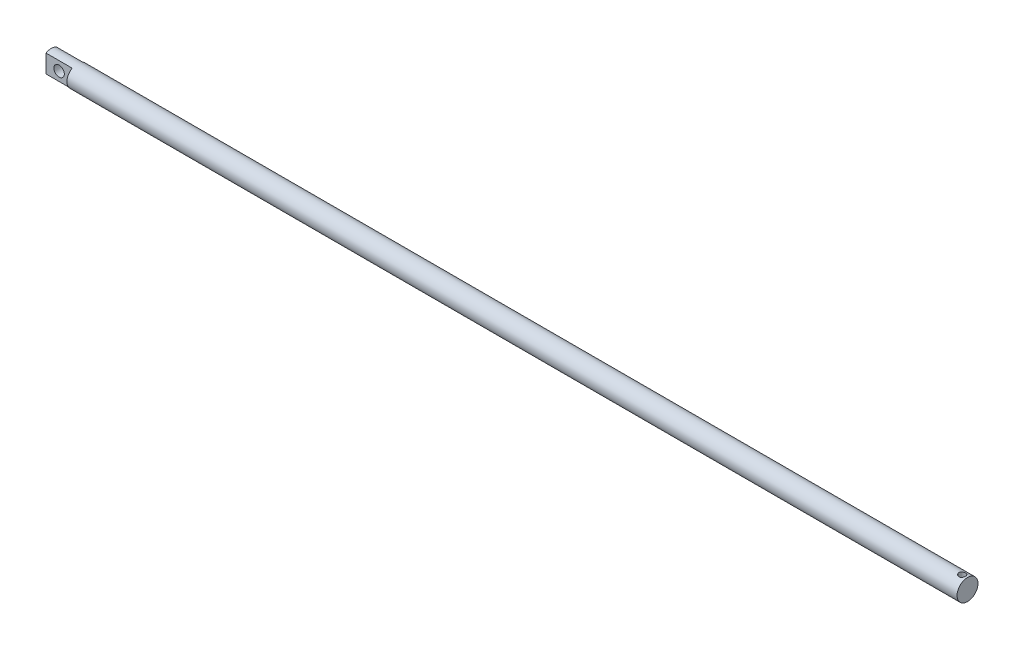
ISO-10303-21;
HEADER;
FILE_DESCRIPTION(('STEP AP214'),'2;1');
FILE_NAME('part.step','',(''),(''),'','','');
FILE_SCHEMA(('AUTOMOTIVE_DESIGN { 1 0 10303 214 1 1 1 1 }'));
ENDSEC;
DATA;
#1=APPLICATION_CONTEXT('core data for automotive mechanical design processes');
#2=APPLICATION_PROTOCOL_DEFINITION('international standard','automotive_design',2000,#1);
#3=PRODUCT_CONTEXT('',#1,'mechanical');
#4=PRODUCT('Part','Part','',(#3));
#5=PRODUCT_RELATED_PRODUCT_CATEGORY('part','',(#4));
#6=PRODUCT_DEFINITION_FORMATION('','',#4);
#7=PRODUCT_DEFINITION_CONTEXT('part definition',#1,'design');
#8=PRODUCT_DEFINITION('design','',#6,#7);
#9=PRODUCT_DEFINITION_SHAPE('','',#8);
#10=(LENGTH_UNIT() NAMED_UNIT(*) SI_UNIT(.MILLI.,.METRE.));
#11=(NAMED_UNIT(*) PLANE_ANGLE_UNIT() SI_UNIT($,.RADIAN.));
#12=(NAMED_UNIT(*) SI_UNIT($,.STERADIAN.) SOLID_ANGLE_UNIT());
#13=UNCERTAINTY_MEASURE_WITH_UNIT(LENGTH_MEASURE(1.E-05),#10,'distance_accuracy_value','');
#14=(GEOMETRIC_REPRESENTATION_CONTEXT(3) GLOBAL_UNCERTAINTY_ASSIGNED_CONTEXT((#13)) GLOBAL_UNIT_ASSIGNED_CONTEXT((#10,
#11,#12)) REPRESENTATION_CONTEXT('',''));
#15=CARTESIAN_POINT('',(0.,0.,0.));
#16=DIRECTION('',(0.,0.,1.));
#17=DIRECTION('',(1.,0.,0.));
#18=AXIS2_PLACEMENT_3D('',#15,#16,#17);
#19=CARTESIAN_POINT('',(700.,0.,0.));
#20=DIRECTION('',(-1.,0.,0.));
#21=DIRECTION('',(0.,0.,1.));
#22=AXIS2_PLACEMENT_3D('',#19,#20,#21);
#23=CYLINDRICAL_SURFACE('',#22,8.);
#24=CARTESIAN_POINT('',(696.,-7.59934207678536,2.49999999999991));
#25=CARTESIAN_POINT('',(696.136694072219,-7.59934291923875,2.49999907560085));
#26=CARTESIAN_POINT('',(696.273397537406,-7.60307063010088,2.4887507758298));
#27=CARTESIAN_POINT('',(696.542788321755,-7.61751277997756,2.44418350802646));
#28=CARTESIAN_POINT('',(696.675474545464,-7.62822910706274,2.41085857565023));
#29=CARTESIAN_POINT('',(696.932889803864,-7.65531877671921,2.32339576447112));
#30=CARTESIAN_POINT('',(697.057632466211,-7.67168210388635,2.26929471473348));
#31=CARTESIAN_POINT('',(697.296305391728,-7.70820812437378,2.14193828346308));
#32=CARTESIAN_POINT('',(697.41023373992,-7.72837148871683,2.06867951811258));
#33=CARTESIAN_POINT('',(697.627957734987,-7.7710025533724,1.90239214124456));
#34=CARTESIAN_POINT('',(697.731327218872,-7.79352246769561,1.80881879944079));
#35=CARTESIAN_POINT('',(697.921192026418,-7.83788491720671,1.60572409291101));
#36=CARTESIAN_POINT('',(698.007684993889,-7.85972735745254,1.49620050503714));
#37=CARTESIAN_POINT('',(698.163222126022,-7.90087106780156,1.26125182498674));
#38=CARTESIAN_POINT('',(698.231827407663,-7.92010369125559,1.13552311304022));
#39=CARTESIAN_POINT('',(698.346752099711,-7.95325103666037,0.873608465706874));
#40=CARTESIAN_POINT('',(698.393076748299,-7.96716700839839,0.737424996974189));
#41=CARTESIAN_POINT('',(698.460702256194,-7.98774351641724,0.4629287139323));
#42=CARTESIAN_POINT('',(698.482731499576,-7.99461477968283,0.324811430936535));
#43=CARTESIAN_POINT('',(698.503448692875,-8.00107191752033,0.0466816279691374));
#44=CARTESIAN_POINT('',(698.502141948718,-8.00065944820141,-0.0933304539460772));
#45=CARTESIAN_POINT('',(698.476703416828,-7.99274232265063,-0.366148960709369));
#46=CARTESIAN_POINT('',(698.453361232974,-7.98548301944275,-0.499037268627971));
#47=CARTESIAN_POINT('',(698.385810019914,-7.96498965121751,-0.758906126695465));
#48=CARTESIAN_POINT('',(698.341599629827,-7.9517551965442,-0.885886290962374));
#49=CARTESIAN_POINT('',(698.23305962185,-7.92046919458914,-1.13215620630937));
#50=CARTESIAN_POINT('',(698.168490382874,-7.90236067233343,-1.25133281124524));
#51=CARTESIAN_POINT('',(698.02125780059,-7.86323445907699,-1.47740502230425));
#52=CARTESIAN_POINT('',(697.938589881722,-7.84221603291311,-1.58429751241871));
#53=CARTESIAN_POINT('',(697.7534527304,-7.79847341467066,-1.78747539690645));
#54=CARTESIAN_POINT('',(697.650301862326,-7.77571463969689,-1.8831330981837));
#55=CARTESIAN_POINT('',(697.429209796343,-7.73181230889311,-2.05597948519516));
#56=CARTESIAN_POINT('',(697.311266858819,-7.710668943514,-2.13316599552365));
#57=CARTESIAN_POINT('',(697.062165062305,-7.67221693265793,-2.26760930038156));
#58=CARTESIAN_POINT('',(696.930873182018,-7.65495380588198,-2.32463361399514));
#59=CARTESIAN_POINT('',(696.659881016316,-7.62675090557703,-2.41556691891079));
#60=CARTESIAN_POINT('',(696.520183771611,-7.61580886035026,-2.44948421529992));
#61=CARTESIAN_POINT('',(696.242360094846,-7.60199126814085,-2.49202970372801));
#62=CARTESIAN_POINT('',(696.10439600753,-7.59880932787515,-2.50161908707785));
#63=CARTESIAN_POINT('',(695.82882051701,-7.60002154919852,-2.49793488996233));
#64=CARTESIAN_POINT('',(695.691209062601,-7.60441454014636,-2.48466484222805));
#65=CARTESIAN_POINT('',(695.424383406695,-7.61997914967835,-2.43649747026375));
#66=CARTESIAN_POINT('',(695.295041451852,-7.63095108204024,-2.40223662321095));
#67=CARTESIAN_POINT('',(695.043956416008,-7.65822574662764,-2.31380747322025));
#68=CARTESIAN_POINT('',(694.922214578158,-7.67452934824625,-2.25963592342297));
#69=CARTESIAN_POINT('',(694.685921780457,-7.71121079306469,-2.13115021311753));
#70=CARTESIAN_POINT('',(694.571677168815,-7.73169206979509,-2.05630294977115));
#71=CARTESIAN_POINT('',(694.357019307276,-7.77420697945615,-1.88921281735959));
#72=CARTESIAN_POINT('',(694.256609662149,-7.79624101471394,-1.79696542938153));
#73=CARTESIAN_POINT('',(694.068179268174,-7.84048375125372,-1.59314589550717));
#74=CARTESIAN_POINT('',(693.98084442772,-7.86266184571363,-1.480931299577));
#75=CARTESIAN_POINT('',(693.826217913357,-7.90378119687354,-1.24290309130275));
#76=CARTESIAN_POINT('',(693.758925321378,-7.92272260181891,-1.1170901022172));
#77=CARTESIAN_POINT('',(693.646938875057,-7.95512623857026,-0.856211046663643));
#78=CARTESIAN_POINT('',(693.602081424313,-7.968627991224,-0.721220368567513));
#79=CARTESIAN_POINT('',(693.535854922821,-7.98880485297152,-0.445114508112817));
#80=CARTESIAN_POINT('',(693.514478521833,-7.99548209828555,-0.304001256680766));
#81=CARTESIAN_POINT('',(693.496417996501,-8.00111606808923,-0.0259698732978645));
#82=CARTESIAN_POINT('',(693.498743099659,-8.0003825881478,0.11087838389298));
#83=CARTESIAN_POINT('',(693.525623622097,-7.99201956162097,0.382146443846431));
#84=CARTESIAN_POINT('',(693.550177591984,-7.98439046465238,0.516566404359069));
#85=CARTESIAN_POINT('',(693.620188018445,-7.96319141689592,0.777510236961502));
#86=CARTESIAN_POINT('',(693.665379215691,-7.94969695920411,0.904111836898873));
#87=CARTESIAN_POINT('',(693.775141654417,-7.91815891175901,1.14799685100009));
#88=CARTESIAN_POINT('',(693.839716219947,-7.90011454182717,1.26527866254889));
#89=CARTESIAN_POINT('',(693.988945516689,-7.86059793766753,1.49152338993931));
#90=CARTESIAN_POINT('',(694.074207044928,-7.83903019501926,1.60006921410615));
#91=CARTESIAN_POINT('',(694.261319778887,-7.79517473094124,1.80164158279855));
#92=CARTESIAN_POINT('',(694.363175948279,-7.77288679569655,1.89466346700823));
#93=CARTESIAN_POINT('',(694.584631439682,-7.72923785154879,2.06565731822494));
#94=CARTESIAN_POINT('',(694.704706806233,-7.70793201726915,2.14302855989409));
#95=CARTESIAN_POINT('',(694.956796240538,-7.66960250559066,2.27640941497031));
#96=CARTESIAN_POINT('',(695.0888054529,-7.65257709722776,2.33242766807083));
#97=CARTESIAN_POINT('',(695.349445234629,-7.62613120880657,2.41742360871577));
#98=CARTESIAN_POINT('',(695.477405094903,-7.616186300875,2.44829879675738));
#99=CARTESIAN_POINT('',(695.736907664193,-7.602792129648,2.48958491632191));
#100=CARTESIAN_POINT('',(695.868449482403,-7.59934126603199,2.50000088961548));
#101=CARTESIAN_POINT('',(696.,-7.59934207678536,2.49999999999991));
#102=B_SPLINE_CURVE_WITH_KNOTS('',3,(#24,#25,#26,#27,#28,#29,#30,#31,#32,#33,#34,#35,#36,#37,
#38,#39,#40,#41,#42,#43,#44,#45,#46,#47,#48,#49,#50,#51,#52,#53,#54,#55,#56,#57,#58,#59,#60,#61,
#62,#63,#64,#65,#66,#67,#68,#69,#70,#71,#72,#73,#74,#75,#76,#77,#78,#79,#80,#81,#82,#83,#84,#85,
#86,#87,#88,#89,#90,#91,#92,#93,#94,#95,#96,#97,#98,#99,#100,#101),.UNSPECIFIED.,.T.,.F.,(4,2,2,
2,2,2,2,2,2,2,2,2,2,2,2,2,2,2,2,2,2,2,2,2,2,2,2,2,2,2,2,2,2,2,2,2,2,2,4),(0.,0.40959627509689,
0.819303254119383,1.22828728823712,1.63734360984975,2.05914161101659,2.48099845882225,
2.91239643927445,3.34369294835818,3.76167445671043,4.17956092943525,4.58301965939478,
4.98650470380163,5.39492809216788,5.80345485426347,6.22900677874635,6.65460879707518,
7.0849694187111,7.51517527910337,7.92809866580704,8.34095824443014,8.74187944093554,
9.14286604511242,9.55535226624049,9.96794576028586,10.3976387562785,10.82731206639,
11.2538047858682,11.6801639628599,12.0887760488387,12.4973614938943,12.9008369303433,
13.3043815982812,13.7216138621525,14.1389711554919,14.5701559100822,15.0011660161246,
15.3954470874758,15.7896309838237),.UNSPECIFIED.);
#103=CARTESIAN_POINT('',(696.,-7.59934207678536,2.49999999999991));
#104=VERTEX_POINT('',#103);
#105=EDGE_CURVE('E40',#104,#104,#102,.T.);
#106=ORIENTED_EDGE('',*,*,#105,.T.);
#107=EDGE_LOOP('',(#106));
#108=FACE_BOUND('',#107,.T.);
#109=CARTESIAN_POINT('',(696.,7.59934207678536,2.49999999999991));
#110=CARTESIAN_POINT('',(695.863305927781,7.59934291923875,2.49999907560085));
#111=CARTESIAN_POINT('',(695.726602462594,7.60307063010088,2.4887507758298));
#112=CARTESIAN_POINT('',(695.457211678244,7.61751277997756,2.44418350802646));
#113=CARTESIAN_POINT('',(695.324525454536,7.62822910706274,2.41085857565023));
#114=CARTESIAN_POINT('',(695.067110196136,7.65531877671921,2.32339576447113));
#115=CARTESIAN_POINT('',(694.942367533789,7.67168210388634,2.2692947147335));
#116=CARTESIAN_POINT('',(694.703694608272,7.70820812437377,2.14193828346311));
#117=CARTESIAN_POINT('',(694.58976626008,7.72837148871682,2.0686795181126));
#118=CARTESIAN_POINT('',(694.372042265013,7.7710025533724,1.90239214124456));
#119=CARTESIAN_POINT('',(694.268672781128,7.79352246769561,1.80881879944079));
#120=CARTESIAN_POINT('',(694.078807973582,7.83788491720671,1.605724092911));
#121=CARTESIAN_POINT('',(693.992315006111,7.85972735745254,1.49620050503714));
#122=CARTESIAN_POINT('',(693.836777873978,7.90087106780156,1.26125182498674));
#123=CARTESIAN_POINT('',(693.768172592337,7.92010369125559,1.13552311304022));
#124=CARTESIAN_POINT('',(693.653247900289,7.95325103666037,0.873608465706874));
#125=CARTESIAN_POINT('',(693.606923251701,7.96716700839839,0.737424996974189));
#126=CARTESIAN_POINT('',(693.539297743806,7.98774351641724,0.4629287139323));
#127=CARTESIAN_POINT('',(693.517268500424,7.99461477968283,0.324811430936535));
#128=CARTESIAN_POINT('',(693.496551307125,8.00107191752033,0.0466816279691373));
#129=CARTESIAN_POINT('',(693.497858051282,8.00065944820141,-0.0933304539460776));
#130=CARTESIAN_POINT('',(693.523296583172,7.99274232265063,-0.36614896070936));
#131=CARTESIAN_POINT('',(693.546638767026,7.98548301944275,-0.499037268627952));
#132=CARTESIAN_POINT('',(693.614189980086,7.96498965121751,-0.758906126695447));
#133=CARTESIAN_POINT('',(693.658400370173,7.9517551965442,-0.885886290962365));
#134=CARTESIAN_POINT('',(693.76694037815,7.92046919458914,-1.13215620630937));
#135=CARTESIAN_POINT('',(693.831509617125,7.90236067233343,-1.25133281124524));
#136=CARTESIAN_POINT('',(693.97874219941,7.86323445907699,-1.47740502230425));
#137=CARTESIAN_POINT('',(694.061410118278,7.84221603291311,-1.58429751241871));
#138=CARTESIAN_POINT('',(694.2465472696,7.79847341467066,-1.78747539690645));
#139=CARTESIAN_POINT('',(694.349698137674,7.77571463969689,-1.8831330981837));
#140=CARTESIAN_POINT('',(694.570790203657,7.73181230889311,-2.05597948519516));
#141=CARTESIAN_POINT('',(694.688733141181,7.710668943514,-2.13316599552365));
#142=CARTESIAN_POINT('',(694.937834937695,7.67221693265793,-2.26760930038156));
#143=CARTESIAN_POINT('',(695.069126817982,7.65495380588198,-2.32463361399514));
#144=CARTESIAN_POINT('',(695.340118983684,7.62675090557703,-2.41556691891079));
#145=CARTESIAN_POINT('',(695.479816228389,7.61580886035026,-2.44948421529992));
#146=CARTESIAN_POINT('',(695.757639905154,7.60199126814085,-2.49202970372801));
#147=CARTESIAN_POINT('',(695.89560399247,7.59880932787515,-2.50161908707785));
#148=CARTESIAN_POINT('',(696.17117948299,7.60002154919852,-2.49793488996233));
#149=CARTESIAN_POINT('',(696.308790937399,7.60441454014636,-2.48466484222805));
#150=CARTESIAN_POINT('',(696.575616593305,7.61997914967835,-2.43649747026375));
#151=CARTESIAN_POINT('',(696.704958548148,7.63095108204024,-2.40223662321095));
#152=CARTESIAN_POINT('',(696.956043583992,7.65822574662764,-2.31380747322025));
#153=CARTESIAN_POINT('',(697.077785421842,7.67452934824625,-2.25963592342297));
#154=CARTESIAN_POINT('',(697.314078219543,7.71121079306469,-2.13115021311753));
#155=CARTESIAN_POINT('',(697.428322831185,7.73169206979509,-2.05630294977115));
#156=CARTESIAN_POINT('',(697.642980692724,7.77420697945615,-1.88921281735959));
#157=CARTESIAN_POINT('',(697.743390337851,7.79624101471394,-1.79696542938153));
#158=CARTESIAN_POINT('',(697.931820731825,7.84048375125372,-1.59314589550717));
#159=CARTESIAN_POINT('',(698.01915557228,7.86266184571363,-1.480931299577));
#160=CARTESIAN_POINT('',(698.173782086642,7.90378119687354,-1.24290309130275));
#161=CARTESIAN_POINT('',(698.241074678622,7.92272260181891,-1.1170901022172));
#162=CARTESIAN_POINT('',(698.353061124943,7.95512623857026,-0.856211046663643));
#163=CARTESIAN_POINT('',(698.397918575687,7.968627991224,-0.721220368567513));
#164=CARTESIAN_POINT('',(698.464145077179,7.98880485297152,-0.445114508112817));
#165=CARTESIAN_POINT('',(698.485521478167,7.99548209828555,-0.304001256680766));
#166=CARTESIAN_POINT('',(698.503582003499,8.00111606808923,-0.0259698732978645));
#167=CARTESIAN_POINT('',(698.501256900341,8.0003825881478,0.11087838389298));
#168=CARTESIAN_POINT('',(698.474376377903,7.99201956162097,0.382146443846431));
#169=CARTESIAN_POINT('',(698.449822408016,7.98439046465238,0.516566404359069));
#170=CARTESIAN_POINT('',(698.379811981555,7.96319141689592,0.777510236961502));
#171=CARTESIAN_POINT('',(698.334620784309,7.94969695920411,0.904111836898873));
#172=CARTESIAN_POINT('',(698.224858345583,7.91815891175901,1.14799685100009));
#173=CARTESIAN_POINT('',(698.160283780053,7.90011454182717,1.26527866254889));
#174=CARTESIAN_POINT('',(698.011054483311,7.86059793766754,1.49152338993927));
#175=CARTESIAN_POINT('',(697.925792955072,7.83903019501927,1.60006921410608));
#176=CARTESIAN_POINT('',(697.738680221113,7.79517473094125,1.80164158279849));
#177=CARTESIAN_POINT('',(697.636824051721,7.77288679569656,1.8946634670082));
#178=CARTESIAN_POINT('',(697.415368560318,7.72923785154879,2.06565731822494));
#179=CARTESIAN_POINT('',(697.295293193767,7.70793201726915,2.14302855989409));
#180=CARTESIAN_POINT('',(697.043203759462,7.66960250559066,2.27640941497031));
#181=CARTESIAN_POINT('',(696.911194547099,7.65257709722776,2.33242766807083));
#182=CARTESIAN_POINT('',(696.650554765371,7.62613120880657,2.41742360871577));
#183=CARTESIAN_POINT('',(696.522594905097,7.616186300875,2.44829879675738));
#184=CARTESIAN_POINT('',(696.263092335807,7.602792129648,2.48958491632191));
#185=CARTESIAN_POINT('',(696.131550517597,7.59934126603199,2.50000088961548));
#186=CARTESIAN_POINT('',(696.,7.59934207678536,2.49999999999991));
#187=B_SPLINE_CURVE_WITH_KNOTS('',3,(#109,#110,#111,#112,#113,#114,#115,#116,#117,#118,#119,
#120,#121,#122,#123,#124,#125,#126,#127,#128,#129,#130,#131,#132,#133,#134,#135,#136,#137,#138,
#139,#140,#141,#142,#143,#144,#145,#146,#147,#148,#149,#150,#151,#152,#153,#154,#155,#156,#157,
#158,#159,#160,#161,#162,#163,#164,#165,#166,#167,#168,#169,#170,#171,#172,#173,#174,#175,#176,
#177,#178,#179,#180,#181,#182,#183,#184,#185,#186),.UNSPECIFIED.,.T.,.F.,(4,2,2,2,2,2,2,2,2,2,2,
2,2,2,2,2,2,2,2,2,2,2,2,2,2,2,2,2,2,2,2,2,2,2,2,2,2,2,4),(0.,0.40959627509689,0.819303254119383,
1.228287288237,1.63734360984975,2.05914161101658,2.48099845882225,2.91239643927444,
3.34369294835818,3.76167445671043,4.17956092943525,4.58301965939475,4.98650470380162,
5.39492809216788,5.80345485426347,6.22900677874635,6.65460879707518,7.08496941871109,
7.51517527910337,7.92809866580703,8.34095824443014,8.74187944093554,9.14286604511242,
9.55535226624049,9.96794576028585,10.3976387562785,10.82731206639,11.2538047858682,
11.6801639628599,12.0887760488387,12.4973614938943,12.9008369303433,13.3043815982812,
13.7216138621523,14.1389711554919,14.5701559100822,15.0011660161246,15.3954470874758,
15.7896309838237),.UNSPECIFIED.);
#188=CARTESIAN_POINT('',(696.,7.59934207678536,2.49999999999991));
#189=VERTEX_POINT('',#188);
#190=EDGE_CURVE('E112',#189,#189,#187,.T.);
#191=ORIENTED_EDGE('',*,*,#190,.T.);
#192=EDGE_LOOP('',(#191));
#193=FACE_BOUND('',#192,.T.);
#194=CARTESIAN_POINT('',(700.,0.,0.));
#195=DIRECTION('',(1.,0.,0.));
#196=DIRECTION('',(0.,0.,-1.));
#197=AXIS2_PLACEMENT_3D('',#194,#195,#196);
#198=CIRCLE('',#197,8.);
#199=CARTESIAN_POINT('',(700.,0.,-8.));
#200=VERTEX_POINT('',#199);
#201=EDGE_CURVE('E99',#200,#200,#198,.T.);
#202=ORIENTED_EDGE('',*,*,#201,.F.);
#203=EDGE_LOOP('',(#202));
#204=FACE_BOUND('',#203,.T.);
#205=DIRECTION('',(-1.,0.,0.));
#206=VECTOR('',#205,1.);
#207=CARTESIAN_POINT('',(700.,6.92820323027551,4.));
#208=LINE('',#207,#206);
#209=CARTESIAN_POINT('',(20.,6.92820323027551,4.));
#210=VERTEX_POINT('',#209);
#211=CARTESIAN_POINT('',(0.,6.92820323027551,4.));
#212=VERTEX_POINT('',#211);
#213=EDGE_CURVE('E64',#210,#212,#208,.T.);
#214=ORIENTED_EDGE('',*,*,#213,.F.);
#215=CARTESIAN_POINT('',(20.,0.,0.));
#216=DIRECTION('',(-1.,0.,0.));
#217=DIRECTION('',(0.,0.,1.));
#218=AXIS2_PLACEMENT_3D('',#215,#216,#217);
#219=CIRCLE('',#218,8.);
#220=CARTESIAN_POINT('',(20.,-6.92820323027551,4.));
#221=VERTEX_POINT('',#220);
#222=EDGE_CURVE('E12',#221,#210,#219,.T.);
#223=ORIENTED_EDGE('',*,*,#222,.F.);
#224=DIRECTION('',(-1.,0.,0.));
#225=VECTOR('',#224,1.);
#226=CARTESIAN_POINT('',(700.,-6.92820323027551,4.));
#227=LINE('',#226,#225);
#228=CARTESIAN_POINT('',(0.,-6.92820323027551,4.));
#229=VERTEX_POINT('',#228);
#230=EDGE_CURVE('E111',#229,#221,#227,.F.);
#231=ORIENTED_EDGE('',*,*,#230,.F.);
#232=CARTESIAN_POINT('',(0.,0.,0.));
#233=DIRECTION('',(1.,0.,0.));
#234=DIRECTION('',(0.,0.,-1.));
#235=AXIS2_PLACEMENT_3D('',#232,#233,#234);
#236=CIRCLE('',#235,8.);
#237=CARTESIAN_POINT('',(0.,-6.92820323027551,-4.));
#238=VERTEX_POINT('',#237);
#239=EDGE_CURVE('E100',#229,#238,#236,.T.);
#240=ORIENTED_EDGE('',*,*,#239,.T.);
#241=DIRECTION('',(-1.,0.,0.));
#242=VECTOR('',#241,1.);
#243=CARTESIAN_POINT('',(700.,-6.92820323027551,-4.));
#244=LINE('',#243,#242);
#245=CARTESIAN_POINT('',(20.,-6.92820323027551,-4.));
#246=VERTEX_POINT('',#245);
#247=EDGE_CURVE('E56',#246,#238,#244,.T.);
#248=ORIENTED_EDGE('',*,*,#247,.F.);
#249=CARTESIAN_POINT('',(20.,6.92820323027551,-4.));
#250=VERTEX_POINT('',#249);
#251=EDGE_CURVE('E48',#250,#246,#219,.T.);
#252=ORIENTED_EDGE('',*,*,#251,.F.);
#253=DIRECTION('',(-1.,0.,0.));
#254=VECTOR('',#253,1.);
#255=CARTESIAN_POINT('',(700.,6.92820323027551,-4.));
#256=LINE('',#255,#254);
#257=CARTESIAN_POINT('',(0.,6.92820323027551,-4.));
#258=VERTEX_POINT('',#257);
#259=EDGE_CURVE('E83',#258,#250,#256,.F.);
#260=ORIENTED_EDGE('',*,*,#259,.F.);
#261=EDGE_CURVE('E95',#258,#212,#236,.T.);
#262=ORIENTED_EDGE('',*,*,#261,.T.);
#263=EDGE_LOOP('',(#214,#223,#231,#240,#248,#252,#260,#262));
#264=FACE_BOUND('',#263,.T.);
#265=ADVANCED_FACE('F36',(#108,#193,#204,#264),#23,.T.);
#266=CARTESIAN_POINT('',(0.,0.,0.));
#267=DIRECTION('',(1.,0.,0.));
#268=DIRECTION('',(0.,0.,-1.));
#269=AXIS2_PLACEMENT_3D('',#266,#267,#268);
#270=PLANE('',#269);
#271=DIRECTION('',(0.,1.,0.));
#272=VECTOR('',#271,1.);
#273=CARTESIAN_POINT('',(0.,10.,4.));
#274=LINE('',#273,#272);
#275=EDGE_CURVE('E90',#229,#212,#274,.T.);
#276=ORIENTED_EDGE('',*,*,#275,.T.);
#277=ORIENTED_EDGE('',*,*,#261,.F.);
#278=DIRECTION('',(0.,-1.,0.));
#279=VECTOR('',#278,1.);
#280=CARTESIAN_POINT('',(0.,10.,-4.));
#281=LINE('',#280,#279);
#282=EDGE_CURVE('E80',#258,#238,#281,.T.);
#283=ORIENTED_EDGE('',*,*,#282,.T.);
#284=ORIENTED_EDGE('',*,*,#239,.F.);
#285=EDGE_LOOP('',(#276,#277,#283,#284));
#286=FACE_BOUND('',#285,.T.);
#287=ADVANCED_FACE('F98',(#286),#270,.F.);
#288=CARTESIAN_POINT('',(700.,0.,0.));
#289=DIRECTION('',(1.,0.,0.));
#290=DIRECTION('',(0.,0.,-1.));
#291=AXIS2_PLACEMENT_3D('',#288,#289,#290);
#292=PLANE('',#291);
#293=ORIENTED_EDGE('',*,*,#201,.T.);
#294=EDGE_LOOP('',(#293));
#295=FACE_BOUND('',#294,.T.);
#296=ADVANCED_FACE('F126',(#295),#292,.T.);
#297=CARTESIAN_POINT('',(20.,10.,-4.));
#298=DIRECTION('',(0.,0.,-1.));
#299=DIRECTION('',(0.,1.,0.));
#300=AXIS2_PLACEMENT_3D('',#297,#298,#299);
#301=PLANE('',#300);
#302=CARTESIAN_POINT('',(10.,0.,-4.));
#303=DIRECTION('',(0.,0.,-1.));
#304=DIRECTION('',(0.,1.,0.));
#305=AXIS2_PLACEMENT_3D('',#302,#303,#304);
#306=CIRCLE('',#305,4.);
#307=CARTESIAN_POINT('',(10.,4.,-4.));
#308=VERTEX_POINT('',#307);
#309=EDGE_CURVE('E96',#308,#308,#306,.F.);
#310=ORIENTED_EDGE('',*,*,#309,.T.);
#311=EDGE_LOOP('',(#310));
#312=FACE_BOUND('',#311,.T.);
#313=ORIENTED_EDGE('',*,*,#247,.T.);
#314=ORIENTED_EDGE('',*,*,#282,.F.);
#315=ORIENTED_EDGE('',*,*,#259,.T.);
#316=DIRECTION('',(0.,-1.,0.));
#317=VECTOR('',#316,1.);
#318=CARTESIAN_POINT('',(20.,10.,-4.));
#319=LINE('',#318,#317);
#320=EDGE_CURVE('E108',#250,#246,#319,.T.);
#321=ORIENTED_EDGE('',*,*,#320,.T.);
#322=EDGE_LOOP('',(#313,#314,#315,#321));
#323=FACE_BOUND('',#322,.T.);
#324=ADVANCED_FACE('F82',(#312,#323),#301,.T.);
#325=CARTESIAN_POINT('',(20.,0.,0.));
#326=DIRECTION('',(-1.,0.,0.));
#327=DIRECTION('',(0.,0.,1.));
#328=AXIS2_PLACEMENT_3D('',#325,#326,#327);
#329=PLANE('',#328);
#330=ORIENTED_EDGE('',*,*,#251,.T.);
#331=ORIENTED_EDGE('',*,*,#320,.F.);
#332=EDGE_LOOP('',(#330,#331));
#333=FACE_BOUND('',#332,.T.);
#334=ADVANCED_FACE('F125',(#333),#329,.T.);
#335=ORIENTED_EDGE('',*,*,#222,.T.);
#336=DIRECTION('',(0.,1.,0.));
#337=VECTOR('',#336,1.);
#338=CARTESIAN_POINT('',(20.,10.,4.));
#339=LINE('',#338,#337);
#340=EDGE_CURVE('E89',#221,#210,#339,.T.);
#341=ORIENTED_EDGE('',*,*,#340,.F.);
#342=EDGE_LOOP('',(#335,#341));
#343=FACE_BOUND('',#342,.T.);
#344=ADVANCED_FACE('F131',(#343),#329,.T.);
#345=CARTESIAN_POINT('',(20.,10.,4.));
#346=DIRECTION('',(0.,0.,1.));
#347=DIRECTION('',(0.,-1.,0.));
#348=AXIS2_PLACEMENT_3D('',#345,#346,#347);
#349=PLANE('',#348);
#350=CARTESIAN_POINT('',(10.,0.,4.));
#351=DIRECTION('',(0.,0.,1.));
#352=DIRECTION('',(0.,-1.,0.));
#353=AXIS2_PLACEMENT_3D('',#350,#351,#352);
#354=CIRCLE('',#353,4.);
#355=CARTESIAN_POINT('',(10.,-4.,4.));
#356=VERTEX_POINT('',#355);
#357=EDGE_CURVE('E109',#356,#356,#354,.F.);
#358=ORIENTED_EDGE('',*,*,#357,.T.);
#359=EDGE_LOOP('',(#358));
#360=FACE_BOUND('',#359,.T.);
#361=ORIENTED_EDGE('',*,*,#213,.T.);
#362=ORIENTED_EDGE('',*,*,#275,.F.);
#363=ORIENTED_EDGE('',*,*,#230,.T.);
#364=ORIENTED_EDGE('',*,*,#340,.T.);
#365=EDGE_LOOP('',(#361,#362,#363,#364));
#366=FACE_BOUND('',#365,.T.);
#367=ADVANCED_FACE('F128',(#360,#366),#349,.T.);
#368=CARTESIAN_POINT('',(10.,0.,-8.));
#369=DIRECTION('',(0.,0.,1.));
#370=DIRECTION('',(1.,0.,0.));
#371=AXIS2_PLACEMENT_3D('',#368,#369,#370);
#372=CYLINDRICAL_SURFACE('',#371,4.);
#373=ORIENTED_EDGE('',*,*,#309,.F.);
#374=EDGE_LOOP('',(#373));
#375=FACE_BOUND('',#374,.T.);
#376=ORIENTED_EDGE('',*,*,#357,.F.);
#377=EDGE_LOOP('',(#376));
#378=FACE_BOUND('',#377,.T.);
#379=ADVANCED_FACE('F120',(#375,#378),#372,.F.);
#380=CARTESIAN_POINT('',(696.,-10.,0.));
#381=DIRECTION('',(0.,1.,0.));
#382=DIRECTION('',(0.,0.,1.));
#383=AXIS2_PLACEMENT_3D('',#380,#381,#382);
#384=CYLINDRICAL_SURFACE('',#383,2.49999999999991);
#385=ORIENTED_EDGE('',*,*,#190,.F.);
#386=EDGE_LOOP('',(#385));
#387=FACE_BOUND('',#386,.T.);
#388=ORIENTED_EDGE('',*,*,#105,.F.);
#389=EDGE_LOOP('',(#388));
#390=FACE_BOUND('',#389,.T.);
#391=ADVANCED_FACE('F116',(#387,#390),#384,.F.);
#392=CLOSED_SHELL('',(#265,#287,#296,#324,#334,#344,#367,#379,#391));
#393=MANIFOLD_SOLID_BREP('B2',#392);
#394=ADVANCED_BREP_SHAPE_REPRESENTATION('',(#18,#393),#14);
#395=SHAPE_DEFINITION_REPRESENTATION(#9,#394);
ENDSEC;
END-ISO-10303-21;
